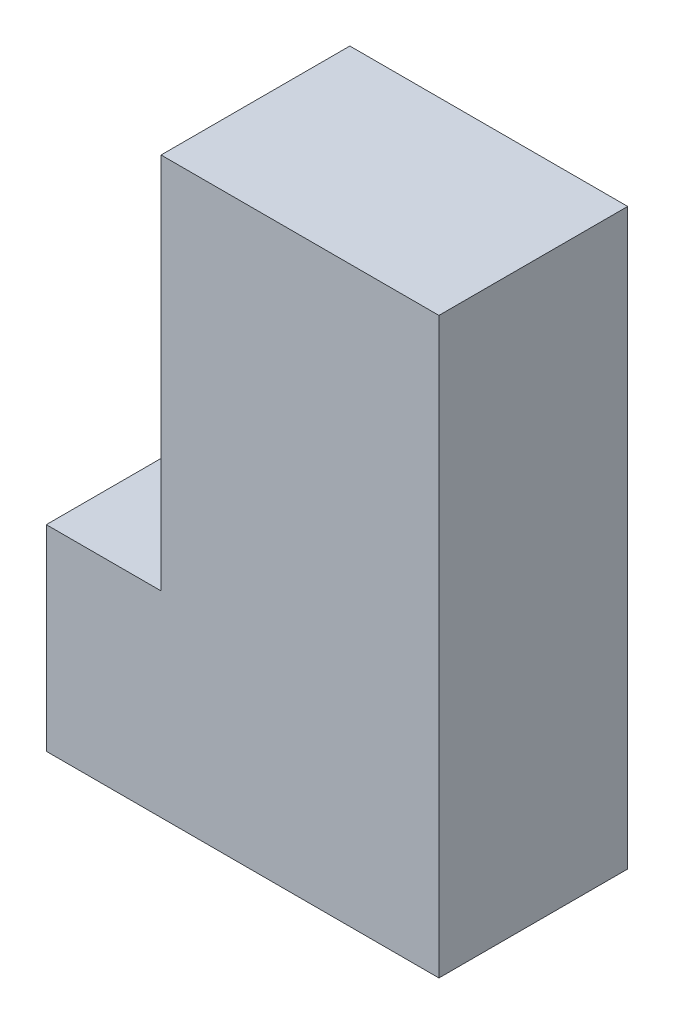
ISO-10303-21;
HEADER;
FILE_DESCRIPTION(('STEP AP214'),'2;1');
FILE_NAME('part.step','',(''),(''),'','','');
FILE_SCHEMA(('AUTOMOTIVE_DESIGN { 1 0 10303 214 1 1 1 1 }'));
ENDSEC;
DATA;
#1=APPLICATION_CONTEXT('core data for automotive mechanical design processes');
#2=APPLICATION_PROTOCOL_DEFINITION('international standard','automotive_design',2000,#1);
#3=PRODUCT_CONTEXT('',#1,'mechanical');
#4=PRODUCT('Part','Part','',(#3));
#5=PRODUCT_RELATED_PRODUCT_CATEGORY('part','',(#4));
#6=PRODUCT_DEFINITION_FORMATION('','',#4);
#7=PRODUCT_DEFINITION_CONTEXT('part definition',#1,'design');
#8=PRODUCT_DEFINITION('design','',#6,#7);
#9=PRODUCT_DEFINITION_SHAPE('','',#8);
#10=(LENGTH_UNIT() NAMED_UNIT(*) SI_UNIT(.MILLI.,.METRE.));
#11=(NAMED_UNIT(*) PLANE_ANGLE_UNIT() SI_UNIT($,.RADIAN.));
#12=(NAMED_UNIT(*) SI_UNIT($,.STERADIAN.) SOLID_ANGLE_UNIT());
#13=UNCERTAINTY_MEASURE_WITH_UNIT(LENGTH_MEASURE(1.E-05),#10,'distance_accuracy_value','');
#14=(GEOMETRIC_REPRESENTATION_CONTEXT(3) GLOBAL_UNCERTAINTY_ASSIGNED_CONTEXT((#13)) GLOBAL_UNIT_ASSIGNED_CONTEXT((#10,
#11,#12)) REPRESENTATION_CONTEXT('',''));
#15=CARTESIAN_POINT('',(0.,0.,0.));
#16=DIRECTION('',(0.,0.,1.));
#17=DIRECTION('',(1.,0.,0.));
#18=AXIS2_PLACEMENT_3D('',#15,#16,#17);
#19=CARTESIAN_POINT('',(0.,13.,12.5));
#20=DIRECTION('',(1.,0.,0.));
#21=DIRECTION('',(0.,1.,0.));
#22=AXIS2_PLACEMENT_3D('',#19,#20,#21);
#23=PLANE('',#22);
#24=DIRECTION('',(0.,-1.,0.));
#25=VECTOR('',#24,1.);
#26=CARTESIAN_POINT('',(0.,13.,0.));
#27=LINE('',#26,#25);
#28=CARTESIAN_POINT('',(0.,13.,0.));
#29=VERTEX_POINT('',#28);
#30=CARTESIAN_POINT('',(0.,0.,0.));
#31=VERTEX_POINT('',#30);
#32=EDGE_CURVE('E117',#29,#31,#27,.T.);
#33=ORIENTED_EDGE('',*,*,#32,.T.);
#34=DIRECTION('',(0.,0.,-1.));
#35=VECTOR('',#34,1.);
#36=CARTESIAN_POINT('',(0.,0.,12.5));
#37=LINE('',#36,#35);
#38=CARTESIAN_POINT('',(0.,0.,12.5));
#39=VERTEX_POINT('',#38);
#40=EDGE_CURVE('E11',#39,#31,#37,.T.);
#41=ORIENTED_EDGE('',*,*,#40,.F.);
#42=DIRECTION('',(0.,-1.,0.));
#43=VECTOR('',#42,1.);
#44=CARTESIAN_POINT('',(0.,13.,12.5));
#45=LINE('',#44,#43);
#46=CARTESIAN_POINT('',(0.,13.,12.5));
#47=VERTEX_POINT('',#46);
#48=EDGE_CURVE('E127',#47,#39,#45,.T.);
#49=ORIENTED_EDGE('',*,*,#48,.F.);
#50=DIRECTION('',(0.,0.,-1.));
#51=VECTOR('',#50,1.);
#52=CARTESIAN_POINT('',(0.,13.,12.5));
#53=LINE('',#52,#51);
#54=EDGE_CURVE('E113',#47,#29,#53,.T.);
#55=ORIENTED_EDGE('',*,*,#54,.T.);
#56=EDGE_LOOP('',(#33,#41,#49,#55));
#57=FACE_BOUND('',#56,.T.);
#58=ADVANCED_FACE('F33',(#57),#23,.F.);
#59=CARTESIAN_POINT('',(0.,0.,12.5));
#60=DIRECTION('',(0.,1.,0.));
#61=DIRECTION('',(0.,0.,1.));
#62=AXIS2_PLACEMENT_3D('',#59,#60,#61);
#63=PLANE('',#62);
#64=DIRECTION('',(1.,0.,0.));
#65=VECTOR('',#64,1.);
#66=CARTESIAN_POINT('',(0.,0.,0.));
#67=LINE('',#66,#65);
#68=CARTESIAN_POINT('',(26.,0.,0.));
#69=VERTEX_POINT('',#68);
#70=EDGE_CURVE('E120',#31,#69,#67,.T.);
#71=ORIENTED_EDGE('',*,*,#70,.T.);
#72=DIRECTION('',(0.,0.,-1.));
#73=VECTOR('',#72,1.);
#74=CARTESIAN_POINT('',(26.,0.,12.5));
#75=LINE('',#74,#73);
#76=CARTESIAN_POINT('',(26.,0.,12.5));
#77=VERTEX_POINT('',#76);
#78=EDGE_CURVE('E41',#77,#69,#75,.T.);
#79=ORIENTED_EDGE('',*,*,#78,.F.);
#80=DIRECTION('',(1.,0.,0.));
#81=VECTOR('',#80,1.);
#82=CARTESIAN_POINT('',(0.,0.,12.5));
#83=LINE('',#82,#81);
#84=EDGE_CURVE('E86',#39,#77,#83,.T.);
#85=ORIENTED_EDGE('',*,*,#84,.F.);
#86=ORIENTED_EDGE('',*,*,#40,.T.);
#87=EDGE_LOOP('',(#71,#79,#85,#86));
#88=FACE_BOUND('',#87,.T.);
#89=ADVANCED_FACE('F151',(#88),#63,.F.);
#90=CARTESIAN_POINT('',(26.,0.,12.5));
#91=DIRECTION('',(-1.,0.,0.));
#92=DIRECTION('',(0.,0.,1.));
#93=AXIS2_PLACEMENT_3D('',#90,#91,#92);
#94=PLANE('',#93);
#95=DIRECTION('',(0.,1.,0.));
#96=VECTOR('',#95,1.);
#97=CARTESIAN_POINT('',(26.,0.,0.));
#98=LINE('',#97,#96);
#99=CARTESIAN_POINT('',(26.,38.,0.));
#100=VERTEX_POINT('',#99);
#101=EDGE_CURVE('E122',#69,#100,#98,.T.);
#102=ORIENTED_EDGE('',*,*,#101,.T.);
#103=DIRECTION('',(0.,0.,-1.));
#104=VECTOR('',#103,1.);
#105=CARTESIAN_POINT('',(26.,38.,12.5));
#106=LINE('',#105,#104);
#107=CARTESIAN_POINT('',(26.,38.,12.5));
#108=VERTEX_POINT('',#107);
#109=EDGE_CURVE('E108',#108,#100,#106,.T.);
#110=ORIENTED_EDGE('',*,*,#109,.F.);
#111=DIRECTION('',(0.,1.,0.));
#112=VECTOR('',#111,1.);
#113=CARTESIAN_POINT('',(26.,0.,12.5));
#114=LINE('',#113,#112);
#115=EDGE_CURVE('E99',#77,#108,#114,.T.);
#116=ORIENTED_EDGE('',*,*,#115,.F.);
#117=ORIENTED_EDGE('',*,*,#78,.T.);
#118=EDGE_LOOP('',(#102,#110,#116,#117));
#119=FACE_BOUND('',#118,.T.);
#120=ADVANCED_FACE('F133',(#119),#94,.F.);
#121=CARTESIAN_POINT('',(26.,38.,12.5));
#122=DIRECTION('',(0.,-1.,0.));
#123=DIRECTION('',(1.,0.,0.));
#124=AXIS2_PLACEMENT_3D('',#121,#122,#123);
#125=PLANE('',#124);
#126=DIRECTION('',(-1.,0.,0.));
#127=VECTOR('',#126,1.);
#128=CARTESIAN_POINT('',(26.,38.,0.));
#129=LINE('',#128,#127);
#130=CARTESIAN_POINT('',(7.6,38.,0.));
#131=VERTEX_POINT('',#130);
#132=EDGE_CURVE('E107',#100,#131,#129,.T.);
#133=ORIENTED_EDGE('',*,*,#132,.T.);
#134=DIRECTION('',(0.,0.,-1.));
#135=VECTOR('',#134,1.);
#136=CARTESIAN_POINT('',(7.6,38.,12.5));
#137=LINE('',#136,#135);
#138=CARTESIAN_POINT('',(7.6,38.,12.5));
#139=VERTEX_POINT('',#138);
#140=EDGE_CURVE('E104',#139,#131,#137,.T.);
#141=ORIENTED_EDGE('',*,*,#140,.F.);
#142=DIRECTION('',(-1.,0.,0.));
#143=VECTOR('',#142,1.);
#144=CARTESIAN_POINT('',(26.,38.,12.5));
#145=LINE('',#144,#143);
#146=EDGE_CURVE('E93',#108,#139,#145,.T.);
#147=ORIENTED_EDGE('',*,*,#146,.F.);
#148=ORIENTED_EDGE('',*,*,#109,.T.);
#149=EDGE_LOOP('',(#133,#141,#147,#148));
#150=FACE_BOUND('',#149,.T.);
#151=ADVANCED_FACE('F105',(#150),#125,.F.);
#152=CARTESIAN_POINT('',(7.6,38.,12.5));
#153=DIRECTION('',(1.,0.,0.));
#154=DIRECTION('',(0.,1.,0.));
#155=AXIS2_PLACEMENT_3D('',#152,#153,#154);
#156=PLANE('',#155);
#157=DIRECTION('',(0.,-1.,0.));
#158=VECTOR('',#157,1.);
#159=CARTESIAN_POINT('',(7.6,38.,0.));
#160=LINE('',#159,#158);
#161=CARTESIAN_POINT('',(7.6,13.,0.));
#162=VERTEX_POINT('',#161);
#163=EDGE_CURVE('E72',#131,#162,#160,.T.);
#164=ORIENTED_EDGE('',*,*,#163,.T.);
#165=DIRECTION('',(0.,0.,-1.));
#166=VECTOR('',#165,1.);
#167=CARTESIAN_POINT('',(7.6,13.,12.5));
#168=LINE('',#167,#166);
#169=CARTESIAN_POINT('',(7.6,13.,12.5));
#170=VERTEX_POINT('',#169);
#171=EDGE_CURVE('E109',#170,#162,#168,.T.);
#172=ORIENTED_EDGE('',*,*,#171,.F.);
#173=DIRECTION('',(0.,-1.,0.));
#174=VECTOR('',#173,1.);
#175=CARTESIAN_POINT('',(7.6,38.,12.5));
#176=LINE('',#175,#174);
#177=EDGE_CURVE('E97',#139,#170,#176,.T.);
#178=ORIENTED_EDGE('',*,*,#177,.F.);
#179=ORIENTED_EDGE('',*,*,#140,.T.);
#180=EDGE_LOOP('',(#164,#172,#178,#179));
#181=FACE_BOUND('',#180,.T.);
#182=ADVANCED_FACE('F111',(#181),#156,.F.);
#183=CARTESIAN_POINT('',(7.6,13.,12.5));
#184=DIRECTION('',(0.,-1.,0.));
#185=DIRECTION('',(1.,0.,0.));
#186=AXIS2_PLACEMENT_3D('',#183,#184,#185);
#187=PLANE('',#186);
#188=DIRECTION('',(-1.,0.,0.));
#189=VECTOR('',#188,1.);
#190=CARTESIAN_POINT('',(7.6,13.,0.));
#191=LINE('',#190,#189);
#192=EDGE_CURVE('E78',#162,#29,#191,.T.);
#193=ORIENTED_EDGE('',*,*,#192,.T.);
#194=ORIENTED_EDGE('',*,*,#54,.F.);
#195=DIRECTION('',(-1.,0.,0.));
#196=VECTOR('',#195,1.);
#197=CARTESIAN_POINT('',(7.6,13.,12.5));
#198=LINE('',#197,#196);
#199=EDGE_CURVE('E49',#170,#47,#198,.T.);
#200=ORIENTED_EDGE('',*,*,#199,.F.);
#201=ORIENTED_EDGE('',*,*,#171,.T.);
#202=EDGE_LOOP('',(#193,#194,#200,#201));
#203=FACE_BOUND('',#202,.T.);
#204=ADVANCED_FACE('F140',(#203),#187,.F.);
#205=CARTESIAN_POINT('',(0.,0.,12.5));
#206=DIRECTION('',(0.,0.,1.));
#207=DIRECTION('',(1.,0.,0.));
#208=AXIS2_PLACEMENT_3D('',#205,#206,#207);
#209=PLANE('',#208);
#210=ORIENTED_EDGE('',*,*,#48,.T.);
#211=ORIENTED_EDGE('',*,*,#84,.T.);
#212=ORIENTED_EDGE('',*,*,#115,.T.);
#213=ORIENTED_EDGE('',*,*,#146,.T.);
#214=ORIENTED_EDGE('',*,*,#177,.T.);
#215=ORIENTED_EDGE('',*,*,#199,.T.);
#216=EDGE_LOOP('',(#210,#211,#212,#213,#214,#215));
#217=FACE_BOUND('',#216,.T.);
#218=ADVANCED_FACE('F95',(#217),#209,.T.);
#219=CARTESIAN_POINT('',(0.,0.,0.));
#220=DIRECTION('',(0.,0.,1.));
#221=DIRECTION('',(1.,0.,0.));
#222=AXIS2_PLACEMENT_3D('',#219,#220,#221);
#223=PLANE('',#222);
#224=ORIENTED_EDGE('',*,*,#32,.F.);
#225=ORIENTED_EDGE('',*,*,#192,.F.);
#226=ORIENTED_EDGE('',*,*,#163,.F.);
#227=ORIENTED_EDGE('',*,*,#132,.F.);
#228=ORIENTED_EDGE('',*,*,#101,.F.);
#229=ORIENTED_EDGE('',*,*,#70,.F.);
#230=EDGE_LOOP('',(#224,#225,#226,#227,#228,#229));
#231=FACE_BOUND('',#230,.T.);
#232=ADVANCED_FACE('F136',(#231),#223,.F.);
#233=CLOSED_SHELL('',(#58,#89,#120,#151,#182,#204,#218,#232));
#234=MANIFOLD_SOLID_BREP('B2',#233);
#235=ADVANCED_BREP_SHAPE_REPRESENTATION('',(#18,#234),#14);
#236=SHAPE_DEFINITION_REPRESENTATION(#9,#235);
ENDSEC;
END-ISO-10303-21;
